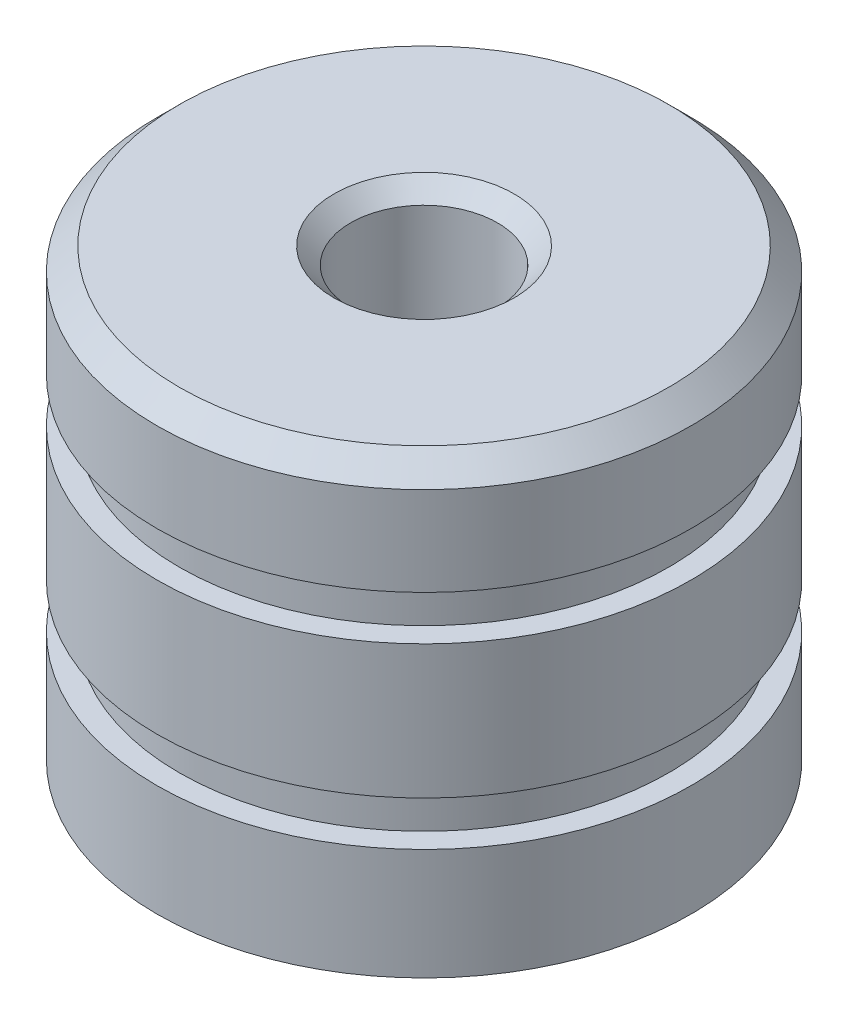
ISO-10303-21;
HEADER;
FILE_DESCRIPTION(('STEP AP214'),'2;1');
FILE_NAME('part.step','',(''),(''),'','','');
FILE_SCHEMA(('AUTOMOTIVE_DESIGN { 1 0 10303 214 1 1 1 1 }'));
ENDSEC;
DATA;
#1=APPLICATION_CONTEXT('core data for automotive mechanical design processes');
#2=APPLICATION_PROTOCOL_DEFINITION('international standard','automotive_design',2000,#1);
#3=PRODUCT_CONTEXT('',#1,'mechanical');
#4=PRODUCT('Part','Part','',(#3));
#5=PRODUCT_RELATED_PRODUCT_CATEGORY('part','',(#4));
#6=PRODUCT_DEFINITION_FORMATION('','',#4);
#7=PRODUCT_DEFINITION_CONTEXT('part definition',#1,'design');
#8=PRODUCT_DEFINITION('design','',#6,#7);
#9=PRODUCT_DEFINITION_SHAPE('','',#8);
#10=(LENGTH_UNIT() NAMED_UNIT(*) SI_UNIT(.MILLI.,.METRE.));
#11=(NAMED_UNIT(*) PLANE_ANGLE_UNIT() SI_UNIT($,.RADIAN.));
#12=(NAMED_UNIT(*) SI_UNIT($,.STERADIAN.) SOLID_ANGLE_UNIT());
#13=UNCERTAINTY_MEASURE_WITH_UNIT(LENGTH_MEASURE(1.E-05),#10,'distance_accuracy_value','');
#14=(GEOMETRIC_REPRESENTATION_CONTEXT(3) GLOBAL_UNCERTAINTY_ASSIGNED_CONTEXT((#13)) GLOBAL_UNIT_ASSIGNED_CONTEXT((#10,
#11,#12)) REPRESENTATION_CONTEXT('',''));
#15=CARTESIAN_POINT('',(0.,0.,0.));
#16=DIRECTION('',(0.,0.,1.));
#17=DIRECTION('',(1.,0.,0.));
#18=AXIS2_PLACEMENT_3D('',#15,#16,#17);
#19=CARTESIAN_POINT('',(0.,5.,0.));
#20=DIRECTION('',(0.,-1.,0.));
#21=DIRECTION('',(0.,0.,-1.));
#22=AXIS2_PLACEMENT_3D('',#19,#20,#21);
#23=CYLINDRICAL_SURFACE('',#22,6.);
#24=CARTESIAN_POINT('',(0.,1.5,0.));
#25=DIRECTION('',(0.,1.,0.));
#26=DIRECTION('',(0.,0.,1.));
#27=AXIS2_PLACEMENT_3D('',#24,#25,#26);
#28=CIRCLE('',#27,6.);
#29=CARTESIAN_POINT('',(0.,1.5,6.));
#30=VERTEX_POINT('',#29);
#31=EDGE_CURVE('E95',#30,#30,#28,.T.);
#32=ORIENTED_EDGE('',*,*,#31,.F.);
#33=EDGE_LOOP('',(#32));
#34=FACE_BOUND('',#33,.T.);
#35=CARTESIAN_POINT('',(0.,-1.5,0.));
#36=DIRECTION('',(0.,1.,0.));
#37=DIRECTION('',(0.,0.,1.));
#38=AXIS2_PLACEMENT_3D('',#35,#36,#37);
#39=CIRCLE('',#38,6.);
#40=CARTESIAN_POINT('',(0.,-1.5,6.));
#41=VERTEX_POINT('',#40);
#42=EDGE_CURVE('E79',#41,#41,#39,.T.);
#43=ORIENTED_EDGE('',*,*,#42,.T.);
#44=EDGE_LOOP('',(#43));
#45=FACE_BOUND('',#44,.T.);
#46=ADVANCED_FACE('F41',(#34,#45),#23,.T.);
#47=CARTESIAN_POINT('',(0.,1.5,0.));
#48=DIRECTION('',(0.,1.,0.));
#49=DIRECTION('',(0.,0.,1.));
#50=AXIS2_PLACEMENT_3D('',#47,#48,#49);
#51=PLANE('',#50);
#52=CARTESIAN_POINT('',(0.,1.5,0.));
#53=DIRECTION('',(0.,1.,0.));
#54=DIRECTION('',(0.,0.,1.));
#55=AXIS2_PLACEMENT_3D('',#52,#53,#54);
#56=CIRCLE('',#55,5.5);
#57=CARTESIAN_POINT('',(0.,1.5,5.5));
#58=VERTEX_POINT('',#57);
#59=EDGE_CURVE('E87',#58,#58,#56,.T.);
#60=ORIENTED_EDGE('',*,*,#59,.F.);
#61=EDGE_LOOP('',(#60));
#62=FACE_BOUND('',#61,.T.);
#63=ORIENTED_EDGE('',*,*,#31,.T.);
#64=EDGE_LOOP('',(#63));
#65=FACE_BOUND('',#64,.T.);
#66=ADVANCED_FACE('F122',(#62,#65),#51,.T.);
#67=CARTESIAN_POINT('',(0.,2.5,0.));
#68=DIRECTION('',(0.,1.,0.));
#69=DIRECTION('',(0.,0.,1.));
#70=AXIS2_PLACEMENT_3D('',#67,#68,#69);
#71=PLANE('',#70);
#72=CARTESIAN_POINT('',(0.,2.5,0.));
#73=DIRECTION('',(0.,1.,0.));
#74=DIRECTION('',(0.,0.,1.));
#75=AXIS2_PLACEMENT_3D('',#72,#73,#74);
#76=CIRCLE('',#75,5.5);
#77=CARTESIAN_POINT('',(0.,2.5,5.5));
#78=VERTEX_POINT('',#77);
#79=EDGE_CURVE('E83',#78,#78,#76,.T.);
#80=ORIENTED_EDGE('',*,*,#79,.T.);
#81=EDGE_LOOP('',(#80));
#82=FACE_BOUND('',#81,.T.);
#83=CARTESIAN_POINT('',(0.,2.5,0.));
#84=DIRECTION('',(0.,1.,0.));
#85=DIRECTION('',(0.,0.,1.));
#86=AXIS2_PLACEMENT_3D('',#83,#84,#85);
#87=CIRCLE('',#86,6.);
#88=CARTESIAN_POINT('',(0.,2.5,6.));
#89=VERTEX_POINT('',#88);
#90=EDGE_CURVE('E91',#89,#89,#87,.T.);
#91=ORIENTED_EDGE('',*,*,#90,.F.);
#92=EDGE_LOOP('',(#91));
#93=FACE_BOUND('',#92,.T.);
#94=ADVANCED_FACE('F127',(#82,#93),#71,.F.);
#95=CARTESIAN_POINT('',(0.,1.5,0.));
#96=DIRECTION('',(0.,1.,0.));
#97=DIRECTION('',(0.,0.,1.));
#98=AXIS2_PLACEMENT_3D('',#95,#96,#97);
#99=CYLINDRICAL_SURFACE('',#98,5.5);
#100=ORIENTED_EDGE('',*,*,#59,.T.);
#101=EDGE_LOOP('',(#100));
#102=FACE_BOUND('',#101,.T.);
#103=ORIENTED_EDGE('',*,*,#79,.F.);
#104=EDGE_LOOP('',(#103));
#105=FACE_BOUND('',#104,.T.);
#106=ADVANCED_FACE('F143',(#102,#105),#99,.T.);
#107=CARTESIAN_POINT('',(0.,5.,0.));
#108=DIRECTION('',(0.,1.,0.));
#109=DIRECTION('',(0.,0.,1.));
#110=AXIS2_PLACEMENT_3D('',#107,#108,#109);
#111=PLANE('',#110);
#112=CARTESIAN_POINT('',(0.,5.,0.));
#113=DIRECTION('',(0.,1.,0.));
#114=DIRECTION('',(0.,0.,1.));
#115=AXIS2_PLACEMENT_3D('',#112,#113,#114);
#116=CIRCLE('',#115,2.025);
#117=CARTESIAN_POINT('',(0.,5.,2.025));
#118=VERTEX_POINT('',#117);
#119=EDGE_CURVE('E71',#118,#118,#116,.T.);
#120=ORIENTED_EDGE('',*,*,#119,.F.);
#121=EDGE_LOOP('',(#120));
#122=FACE_BOUND('',#121,.T.);
#123=CARTESIAN_POINT('',(0.,5.,0.));
#124=DIRECTION('',(0.,1.,0.));
#125=DIRECTION('',(0.,0.,1.));
#126=AXIS2_PLACEMENT_3D('',#123,#124,#125);
#127=CIRCLE('',#126,5.50000000000001);
#128=CARTESIAN_POINT('',(0.,5.,5.50000000000001));
#129=VERTEX_POINT('',#128);
#130=EDGE_CURVE('E49',#129,#129,#127,.T.);
#131=ORIENTED_EDGE('',*,*,#130,.T.);
#132=EDGE_LOOP('',(#131));
#133=FACE_BOUND('',#132,.T.);
#134=ADVANCED_FACE('F109',(#122,#133),#111,.T.);
#135=CARTESIAN_POINT('',(0.,4.5,0.));
#136=DIRECTION('',(0.,1.,0.));
#137=DIRECTION('',(0.,0.,1.));
#138=AXIS2_PLACEMENT_3D('',#135,#136,#137);
#139=CIRCLE('',#138,6.);
#140=CARTESIAN_POINT('',(0.,4.5,6.));
#141=VERTEX_POINT('',#140);
#142=EDGE_CURVE('E11',#141,#141,#139,.F.);
#143=ORIENTED_EDGE('',*,*,#142,.T.);
#144=EDGE_LOOP('',(#143));
#145=FACE_BOUND('',#144,.T.);
#146=ORIENTED_EDGE('',*,*,#90,.T.);
#147=EDGE_LOOP('',(#146));
#148=FACE_BOUND('',#147,.T.);
#149=ADVANCED_FACE('F119',(#145,#148),#23,.T.);
#150=CARTESIAN_POINT('',(0.,-1.5,0.));
#151=DIRECTION('',(0.,-1.,0.));
#152=DIRECTION('',(0.,0.,1.));
#153=AXIS2_PLACEMENT_3D('',#150,#151,#152);
#154=PLANE('',#153);
#155=ORIENTED_EDGE('',*,*,#42,.F.);
#156=EDGE_LOOP('',(#155));
#157=FACE_BOUND('',#156,.T.);
#158=CARTESIAN_POINT('',(0.,-1.5,0.));
#159=DIRECTION('',(0.,1.,0.));
#160=DIRECTION('',(0.,0.,1.));
#161=AXIS2_PLACEMENT_3D('',#158,#159,#160);
#162=CIRCLE('',#161,5.5);
#163=CARTESIAN_POINT('',(0.,-1.5,5.5));
#164=VERTEX_POINT('',#163);
#165=EDGE_CURVE('E68',#164,#164,#162,.T.);
#166=ORIENTED_EDGE('',*,*,#165,.T.);
#167=EDGE_LOOP('',(#166));
#168=FACE_BOUND('',#167,.T.);
#169=ADVANCED_FACE('F134',(#157,#168),#154,.T.);
#170=CARTESIAN_POINT('',(0.,-2.5,0.));
#171=DIRECTION('',(0.,-1.,0.));
#172=DIRECTION('',(0.,0.,1.));
#173=AXIS2_PLACEMENT_3D('',#170,#171,#172);
#174=PLANE('',#173);
#175=CARTESIAN_POINT('',(0.,-2.5,0.));
#176=DIRECTION('',(0.,1.,0.));
#177=DIRECTION('',(0.,0.,1.));
#178=AXIS2_PLACEMENT_3D('',#175,#176,#177);
#179=CIRCLE('',#178,6.);
#180=CARTESIAN_POINT('',(0.,-2.5,6.));
#181=VERTEX_POINT('',#180);
#182=EDGE_CURVE('E77',#181,#181,#179,.T.);
#183=ORIENTED_EDGE('',*,*,#182,.T.);
#184=EDGE_LOOP('',(#183));
#185=FACE_BOUND('',#184,.T.);
#186=CARTESIAN_POINT('',(0.,-2.5,0.));
#187=DIRECTION('',(0.,1.,0.));
#188=DIRECTION('',(0.,0.,1.));
#189=AXIS2_PLACEMENT_3D('',#186,#187,#188);
#190=CIRCLE('',#189,5.5);
#191=CARTESIAN_POINT('',(0.,-2.5,5.5));
#192=VERTEX_POINT('',#191);
#193=EDGE_CURVE('E62',#192,#192,#190,.T.);
#194=ORIENTED_EDGE('',*,*,#193,.F.);
#195=EDGE_LOOP('',(#194));
#196=FACE_BOUND('',#195,.T.);
#197=ADVANCED_FACE('F140',(#185,#196),#174,.F.);
#198=CARTESIAN_POINT('',(0.,-1.5,0.));
#199=DIRECTION('',(0.,-1.,0.));
#200=DIRECTION('',(0.,0.,-1.));
#201=AXIS2_PLACEMENT_3D('',#198,#199,#200);
#202=CYLINDRICAL_SURFACE('',#201,5.5);
#203=ORIENTED_EDGE('',*,*,#165,.F.);
#204=EDGE_LOOP('',(#203));
#205=FACE_BOUND('',#204,.T.);
#206=ORIENTED_EDGE('',*,*,#193,.T.);
#207=EDGE_LOOP('',(#206));
#208=FACE_BOUND('',#207,.T.);
#209=ADVANCED_FACE('F158',(#205,#208),#202,.T.);
#210=CARTESIAN_POINT('',(0.,-5.,0.));
#211=DIRECTION('',(0.,1.,0.));
#212=DIRECTION('',(0.,0.,1.));
#213=AXIS2_PLACEMENT_3D('',#210,#211,#212);
#214=PLANE('',#213);
#215=CARTESIAN_POINT('',(0.,-5.,0.));
#216=DIRECTION('',(0.,1.,0.));
#217=DIRECTION('',(0.,0.,1.));
#218=AXIS2_PLACEMENT_3D('',#215,#216,#217);
#219=CIRCLE('',#218,6.);
#220=CARTESIAN_POINT('',(0.,-5.,6.));
#221=VERTEX_POINT('',#220);
#222=EDGE_CURVE('E99',#221,#221,#219,.T.);
#223=ORIENTED_EDGE('',*,*,#222,.F.);
#224=EDGE_LOOP('',(#223));
#225=FACE_BOUND('',#224,.T.);
#226=ADVANCED_FACE('F117',(#225),#214,.F.);
#227=ORIENTED_EDGE('',*,*,#182,.F.);
#228=EDGE_LOOP('',(#227));
#229=FACE_BOUND('',#228,.T.);
#230=ORIENTED_EDGE('',*,*,#222,.T.);
#231=EDGE_LOOP('',(#230));
#232=FACE_BOUND('',#231,.T.);
#233=ADVANCED_FACE('F112',(#229,#232),#23,.T.);
#234=CARTESIAN_POINT('',(0.,5.,0.));
#235=DIRECTION('',(0.,-1.,0.));
#236=DIRECTION('',(0.,0.,-1.));
#237=AXIS2_PLACEMENT_3D('',#234,#235,#236);
#238=CONICAL_SURFACE('',#237,5.50000000000001,0.785398163397444);
#239=ORIENTED_EDGE('',*,*,#142,.F.);
#240=EDGE_LOOP('',(#239));
#241=FACE_BOUND('',#240,.T.);
#242=ORIENTED_EDGE('',*,*,#130,.F.);
#243=EDGE_LOOP('',(#242));
#244=FACE_BOUND('',#243,.T.);
#245=ADVANCED_FACE('F43',(#241,#244),#238,.T.);
#246=CARTESIAN_POINT('',(0.,-3.,0.));
#247=DIRECTION('',(0.,1.,0.));
#248=DIRECTION('',(0.,0.,1.));
#249=AXIS2_PLACEMENT_3D('',#246,#247,#248);
#250=CONICAL_SURFACE('',#249,1.65,1.02974425867665);
#251=CARTESIAN_POINT('',(0.,-3.99142002139548,0.));
#252=VERTEX_POINT('',#251);
#253=VERTEX_LOOP('',#252);
#254=FACE_BOUND('',#253,.T.);
#255=CARTESIAN_POINT('',(0.,-3.,0.));
#256=DIRECTION('',(0.,1.,0.));
#257=DIRECTION('',(0.,0.,1.));
#258=AXIS2_PLACEMENT_3D('',#255,#256,#257);
#259=CIRCLE('',#258,1.65);
#260=CARTESIAN_POINT('',(0.,-3.,1.65));
#261=VERTEX_POINT('',#260);
#262=EDGE_CURVE('E59',#261,#261,#259,.T.);
#263=ORIENTED_EDGE('',*,*,#262,.T.);
#264=EDGE_LOOP('',(#263));
#265=FACE_BOUND('',#264,.T.);
#266=ADVANCED_FACE('F52',(#254,#265),#250,.F.);
#267=CARTESIAN_POINT('',(0.,5.,0.));
#268=DIRECTION('',(0.,1.,0.));
#269=DIRECTION('',(0.,0.,1.));
#270=AXIS2_PLACEMENT_3D('',#267,#268,#269);
#271=CYLINDRICAL_SURFACE('',#270,1.65);
#272=ORIENTED_EDGE('',*,*,#262,.F.);
#273=EDGE_LOOP('',(#272));
#274=FACE_BOUND('',#273,.T.);
#275=CARTESIAN_POINT('',(0.,4.625,0.));
#276=DIRECTION('',(0.,1.,0.));
#277=DIRECTION('',(0.,0.,1.));
#278=AXIS2_PLACEMENT_3D('',#275,#276,#277);
#279=CIRCLE('',#278,1.65);
#280=CARTESIAN_POINT('',(0.,4.625,1.65));
#281=VERTEX_POINT('',#280);
#282=EDGE_CURVE('E63',#281,#281,#279,.T.);
#283=ORIENTED_EDGE('',*,*,#282,.T.);
#284=EDGE_LOOP('',(#283));
#285=FACE_BOUND('',#284,.T.);
#286=ADVANCED_FACE('F55',(#274,#285),#271,.F.);
#287=CARTESIAN_POINT('',(0.,5.,0.));
#288=DIRECTION('',(0.,1.,0.));
#289=DIRECTION('',(0.,0.,1.));
#290=AXIS2_PLACEMENT_3D('',#287,#288,#289);
#291=CONICAL_SURFACE('',#290,2.025,0.785398163397449);
#292=ORIENTED_EDGE('',*,*,#282,.F.);
#293=EDGE_LOOP('',(#292));
#294=FACE_BOUND('',#293,.T.);
#295=ORIENTED_EDGE('',*,*,#119,.T.);
#296=EDGE_LOOP('',(#295));
#297=FACE_BOUND('',#296,.T.);
#298=ADVANCED_FACE('F177',(#294,#297),#291,.F.);
#299=CLOSED_SHELL('',(#46,#66,#94,#106,#134,#149,#169,#197,#209,#226,#233,#245,#266,#286,#298));
#300=MANIFOLD_SOLID_BREP('B2',#299);
#301=ADVANCED_BREP_SHAPE_REPRESENTATION('',(#18,#300),#14);
#302=SHAPE_DEFINITION_REPRESENTATION(#9,#301);
ENDSEC;
END-ISO-10303-21;
